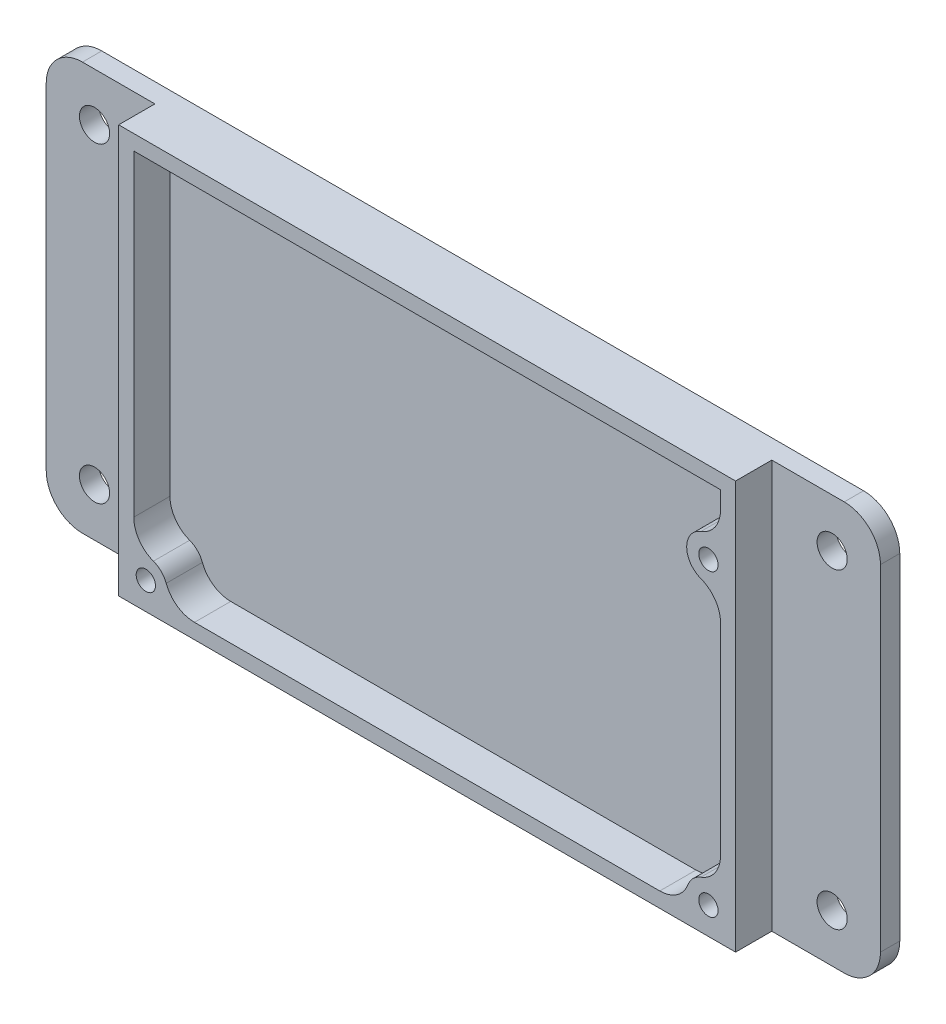
ISO-10303-21;
HEADER;
FILE_DESCRIPTION(('STEP AP214'),'2;1');
FILE_NAME('part.step','',(''),(''),'','','');
FILE_SCHEMA(('AUTOMOTIVE_DESIGN { 1 0 10303 214 1 1 1 1 }'));
ENDSEC;
DATA;
#1=APPLICATION_CONTEXT('core data for automotive mechanical design processes');
#2=APPLICATION_PROTOCOL_DEFINITION('international standard','automotive_design',2000,#1);
#3=PRODUCT_CONTEXT('',#1,'mechanical');
#4=PRODUCT('Part','Part','',(#3));
#5=PRODUCT_RELATED_PRODUCT_CATEGORY('part','',(#4));
#6=PRODUCT_DEFINITION_FORMATION('','',#4);
#7=PRODUCT_DEFINITION_CONTEXT('part definition',#1,'design');
#8=PRODUCT_DEFINITION('design','',#6,#7);
#9=PRODUCT_DEFINITION_SHAPE('','',#8);
#10=(LENGTH_UNIT() NAMED_UNIT(*) SI_UNIT(.MILLI.,.METRE.));
#11=(NAMED_UNIT(*) PLANE_ANGLE_UNIT() SI_UNIT($,.RADIAN.));
#12=(NAMED_UNIT(*) SI_UNIT($,.STERADIAN.) SOLID_ANGLE_UNIT());
#13=UNCERTAINTY_MEASURE_WITH_UNIT(LENGTH_MEASURE(1.E-05),#10,'distance_accuracy_value','');
#14=(GEOMETRIC_REPRESENTATION_CONTEXT(3) GLOBAL_UNCERTAINTY_ASSIGNED_CONTEXT((#13)) GLOBAL_UNIT_ASSIGNED_CONTEXT((#10,
#11,#12)) REPRESENTATION_CONTEXT('',''));
#15=CARTESIAN_POINT('',(0.,0.,0.));
#16=DIRECTION('',(0.,0.,1.));
#17=DIRECTION('',(1.,0.,0.));
#18=AXIS2_PLACEMENT_3D('',#15,#16,#17);
#19=CARTESIAN_POINT('',(0.,0.,6.));
#20=DIRECTION('',(0.,1.,0.));
#21=DIRECTION('',(0.,0.,1.));
#22=AXIS2_PLACEMENT_3D('',#19,#20,#21);
#23=PLANE('',#22);
#24=DIRECTION('',(-1.,0.,0.));
#25=VECTOR('',#24,1.);
#26=CARTESIAN_POINT('',(120.2,0.,-3.2));
#27=LINE('',#26,#25);
#28=CARTESIAN_POINT('',(114.2,0.,-3.2));
#29=VERTEX_POINT('',#28);
#30=CARTESIAN_POINT('',(-12.,0.,-3.2));
#31=VERTEX_POINT('',#30);
#32=EDGE_CURVE('E856',#29,#31,#27,.T.);
#33=ORIENTED_EDGE('',*,*,#32,.F.);
#34=DIRECTION('',(0.,0.,1.));
#35=VECTOR('',#34,1.);
#36=CARTESIAN_POINT('',(114.2,0.,6.));
#37=LINE('',#36,#35);
#38=CARTESIAN_POINT('',(114.2,0.,0.));
#39=VERTEX_POINT('',#38);
#40=EDGE_CURVE('E282',#29,#39,#37,.T.);
#41=ORIENTED_EDGE('',*,*,#40,.T.);
#42=DIRECTION('',(-1.,0.,0.));
#43=VECTOR('',#42,1.);
#44=CARTESIAN_POINT('',(120.2,0.,0.));
#45=LINE('',#44,#43);
#46=CARTESIAN_POINT('',(102.2,0.,0.));
#47=VERTEX_POINT('',#46);
#48=EDGE_CURVE('E866',#39,#47,#45,.T.);
#49=ORIENTED_EDGE('',*,*,#48,.T.);
#50=DIRECTION('',(0.,0.,-1.));
#51=VECTOR('',#50,1.);
#52=CARTESIAN_POINT('',(102.2,0.,6.));
#53=LINE('',#52,#51);
#54=CARTESIAN_POINT('',(102.2,0.,6.));
#55=VERTEX_POINT('',#54);
#56=EDGE_CURVE('E246',#55,#47,#53,.T.);
#57=ORIENTED_EDGE('',*,*,#56,.F.);
#58=DIRECTION('',(1.,0.,0.));
#59=VECTOR('',#58,1.);
#60=CARTESIAN_POINT('',(0.,0.,6.));
#61=LINE('',#60,#59);
#62=CARTESIAN_POINT('',(0.,0.,6.));
#63=VERTEX_POINT('',#62);
#64=EDGE_CURVE('E408',#63,#55,#61,.T.);
#65=ORIENTED_EDGE('',*,*,#64,.F.);
#66=DIRECTION('',(0.,0.,-1.));
#67=VECTOR('',#66,1.);
#68=CARTESIAN_POINT('',(0.,0.,6.));
#69=LINE('',#68,#67);
#70=CARTESIAN_POINT('',(0.,0.,0.));
#71=VERTEX_POINT('',#70);
#72=EDGE_CURVE('E243',#63,#71,#69,.T.);
#73=ORIENTED_EDGE('',*,*,#72,.T.);
#74=CARTESIAN_POINT('',(-12.,0.,0.));
#75=VERTEX_POINT('',#74);
#76=EDGE_CURVE('E232',#71,#75,#45,.T.);
#77=ORIENTED_EDGE('',*,*,#76,.T.);
#78=DIRECTION('',(0.,0.,1.));
#79=VECTOR('',#78,1.);
#80=CARTESIAN_POINT('',(-12.,0.,6.));
#81=LINE('',#80,#79);
#82=EDGE_CURVE('E280',#75,#31,#81,.F.);
#83=ORIENTED_EDGE('',*,*,#82,.T.);
#84=EDGE_LOOP('',(#33,#41,#49,#57,#65,#73,#77,#83));
#85=FACE_BOUND('',#84,.T.);
#86=ADVANCED_FACE('F38',(#85),#23,.F.);
#87=CARTESIAN_POINT('',(102.2,0.,6.));
#88=DIRECTION('',(-1.,0.,0.));
#89=DIRECTION('',(0.,0.,1.));
#90=AXIS2_PLACEMENT_3D('',#87,#88,#89);
#91=PLANE('',#90);
#92=DIRECTION('',(0.,1.,0.));
#93=VECTOR('',#92,1.);
#94=CARTESIAN_POINT('',(102.2,0.,0.));
#95=LINE('',#94,#93);
#96=CARTESIAN_POINT('',(102.2,67.6,0.));
#97=VERTEX_POINT('',#96);
#98=EDGE_CURVE('E236',#47,#97,#95,.T.);
#99=ORIENTED_EDGE('',*,*,#98,.T.);
#100=DIRECTION('',(0.,0.,-1.));
#101=VECTOR('',#100,1.);
#102=CARTESIAN_POINT('',(102.2,67.6,6.));
#103=LINE('',#102,#101);
#104=CARTESIAN_POINT('',(102.2,67.6,6.));
#105=VERTEX_POINT('',#104);
#106=EDGE_CURVE('E242',#105,#97,#103,.T.);
#107=ORIENTED_EDGE('',*,*,#106,.F.);
#108=DIRECTION('',(0.,1.,0.));
#109=VECTOR('',#108,1.);
#110=CARTESIAN_POINT('',(102.2,0.,6.));
#111=LINE('',#110,#109);
#112=EDGE_CURVE('E411',#55,#105,#111,.T.);
#113=ORIENTED_EDGE('',*,*,#112,.F.);
#114=ORIENTED_EDGE('',*,*,#56,.T.);
#115=EDGE_LOOP('',(#99,#107,#113,#114));
#116=FACE_BOUND('',#115,.T.);
#117=ADVANCED_FACE('F478',(#116),#91,.F.);
#118=CARTESIAN_POINT('',(0.,67.6,6.));
#119=DIRECTION('',(0.,1.,0.));
#120=DIRECTION('',(0.,0.,1.));
#121=AXIS2_PLACEMENT_3D('',#118,#119,#120);
#122=PLANE('',#121);
#123=DIRECTION('',(1.,0.,0.));
#124=VECTOR('',#123,1.);
#125=CARTESIAN_POINT('',(120.2,67.6,0.));
#126=LINE('',#125,#124);
#127=CARTESIAN_POINT('',(114.2,67.6,0.));
#128=VERTEX_POINT('',#127);
#129=EDGE_CURVE('E226',#97,#128,#126,.T.);
#130=ORIENTED_EDGE('',*,*,#129,.T.);
#131=DIRECTION('',(0.,0.,1.));
#132=VECTOR('',#131,1.);
#133=CARTESIAN_POINT('',(114.2,67.6,-3.2));
#134=LINE('',#133,#132);
#135=CARTESIAN_POINT('',(114.2,67.6,-3.2));
#136=VERTEX_POINT('',#135);
#137=EDGE_CURVE('E270',#128,#136,#134,.F.);
#138=ORIENTED_EDGE('',*,*,#137,.T.);
#139=DIRECTION('',(1.,0.,0.));
#140=VECTOR('',#139,1.);
#141=CARTESIAN_POINT('',(120.2,67.6,-3.2));
#142=LINE('',#141,#140);
#143=CARTESIAN_POINT('',(-12.,67.6,-3.2));
#144=VERTEX_POINT('',#143);
#145=EDGE_CURVE('E425',#144,#136,#142,.T.);
#146=ORIENTED_EDGE('',*,*,#145,.F.);
#147=DIRECTION('',(0.,0.,1.));
#148=VECTOR('',#147,1.);
#149=CARTESIAN_POINT('',(-12.,67.6,0.));
#150=LINE('',#149,#148);
#151=CARTESIAN_POINT('',(-12.,67.6,0.));
#152=VERTEX_POINT('',#151);
#153=EDGE_CURVE('E223',#144,#152,#150,.T.);
#154=ORIENTED_EDGE('',*,*,#153,.T.);
#155=CARTESIAN_POINT('',(0.,67.6,0.));
#156=VERTEX_POINT('',#155);
#157=EDGE_CURVE('E213',#152,#156,#126,.T.);
#158=ORIENTED_EDGE('',*,*,#157,.T.);
#159=DIRECTION('',(0.,0.,-1.));
#160=VECTOR('',#159,1.);
#161=CARTESIAN_POINT('',(0.,67.6,6.));
#162=LINE('',#161,#160);
#163=CARTESIAN_POINT('',(0.,67.6,6.));
#164=VERTEX_POINT('',#163);
#165=EDGE_CURVE('E219',#164,#156,#162,.T.);
#166=ORIENTED_EDGE('',*,*,#165,.F.);
#167=DIRECTION('',(1.,0.,0.));
#168=VECTOR('',#167,1.);
#169=CARTESIAN_POINT('',(0.,67.6,6.));
#170=LINE('',#169,#168);
#171=EDGE_CURVE('E413',#164,#105,#170,.T.);
#172=ORIENTED_EDGE('',*,*,#171,.T.);
#173=ORIENTED_EDGE('',*,*,#106,.T.);
#174=EDGE_LOOP('',(#130,#138,#146,#154,#158,#166,#172,#173));
#175=FACE_BOUND('',#174,.T.);
#176=ADVANCED_FACE('F216',(#175),#122,.T.);
#177=CARTESIAN_POINT('',(4.5,4.5,6.));
#178=DIRECTION('',(0.,0.,-1.));
#179=DIRECTION('',(-1.,0.,0.));
#180=AXIS2_PLACEMENT_3D('',#177,#178,#179);
#181=CYLINDRICAL_SURFACE('',#180,3.6);
#182=CARTESIAN_POINT('',(4.5,4.5,6.));
#183=DIRECTION('',(0.,0.,1.));
#184=DIRECTION('',(1.,0.,0.));
#185=AXIS2_PLACEMENT_3D('',#182,#183,#184);
#186=CIRCLE('',#185,3.6);
#187=CARTESIAN_POINT('',(7.87386000216723,5.75581395348837,6.));
#188=VERTEX_POINT('',#187);
#189=CARTESIAN_POINT('',(5.75581395348837,7.87386000216723,6.));
#190=VERTEX_POINT('',#189);
#191=EDGE_CURVE('E385',#188,#190,#186,.T.);
#192=ORIENTED_EDGE('',*,*,#191,.F.);
#193=DIRECTION('',(0.,0.,-1.));
#194=VECTOR('',#193,1.);
#195=CARTESIAN_POINT('',(7.87386000216724,5.75581395348837,6.));
#196=LINE('',#195,#194);
#197=CARTESIAN_POINT('',(7.87386000216723,5.75581395348837,0.));
#198=VERTEX_POINT('',#197);
#199=EDGE_CURVE('E315',#188,#198,#196,.T.);
#200=ORIENTED_EDGE('',*,*,#199,.T.);
#201=CARTESIAN_POINT('',(4.5,4.5,0.));
#202=DIRECTION('',(0.,0.,1.));
#203=DIRECTION('',(1.,0.,0.));
#204=AXIS2_PLACEMENT_3D('',#201,#202,#203);
#205=CIRCLE('',#204,3.6);
#206=CARTESIAN_POINT('',(5.75581395348837,7.87386000216723,0.));
#207=VERTEX_POINT('',#206);
#208=EDGE_CURVE('E421',#198,#207,#205,.T.);
#209=ORIENTED_EDGE('',*,*,#208,.T.);
#210=DIRECTION('',(0.,0.,-1.));
#211=VECTOR('',#210,1.);
#212=CARTESIAN_POINT('',(5.75581395348837,7.87386000216724,6.));
#213=LINE('',#212,#211);
#214=EDGE_CURVE('E313',#207,#190,#213,.F.);
#215=ORIENTED_EDGE('',*,*,#214,.T.);
#216=EDGE_LOOP('',(#192,#200,#209,#215));
#217=FACE_BOUND('',#216,.T.);
#218=ADVANCED_FACE('F465',(#217),#181,.T.);
#219=CARTESIAN_POINT('',(2.5,0.,6.));
#220=DIRECTION('',(-1.,0.,0.));
#221=DIRECTION('',(0.,0.,1.));
#222=AXIS2_PLACEMENT_3D('',#219,#220,#221);
#223=PLANE('',#222);
#224=DIRECTION('',(0.,1.,0.));
#225=VECTOR('',#224,1.);
#226=CARTESIAN_POINT('',(2.5,0.,6.));
#227=LINE('',#226,#225);
#228=CARTESIAN_POINT('',(2.5,12.559776671844,6.));
#229=VERTEX_POINT('',#228);
#230=CARTESIAN_POINT('',(2.5,65.1,6.));
#231=VERTEX_POINT('',#230);
#232=EDGE_CURVE('E389',#229,#231,#227,.T.);
#233=ORIENTED_EDGE('',*,*,#232,.F.);
#234=DIRECTION('',(0.,0.,1.));
#235=VECTOR('',#234,1.);
#236=CARTESIAN_POINT('',(2.5,12.559776671844,0.));
#237=LINE('',#236,#235);
#238=CARTESIAN_POINT('',(2.5,12.559776671844,0.));
#239=VERTEX_POINT('',#238);
#240=EDGE_CURVE('E331',#229,#239,#237,.F.);
#241=ORIENTED_EDGE('',*,*,#240,.T.);
#242=DIRECTION('',(0.,1.,0.));
#243=VECTOR('',#242,1.);
#244=CARTESIAN_POINT('',(2.5,0.,0.));
#245=LINE('',#244,#243);
#246=CARTESIAN_POINT('',(2.5,65.1,0.));
#247=VERTEX_POINT('',#246);
#248=EDGE_CURVE('E424',#239,#247,#245,.T.);
#249=ORIENTED_EDGE('',*,*,#248,.T.);
#250=DIRECTION('',(0.,0.,-1.));
#251=VECTOR('',#250,1.);
#252=CARTESIAN_POINT('',(2.5,65.1,6.));
#253=LINE('',#252,#251);
#254=EDGE_CURVE('E248',#231,#247,#253,.T.);
#255=ORIENTED_EDGE('',*,*,#254,.F.);
#256=EDGE_LOOP('',(#233,#241,#249,#255));
#257=FACE_BOUND('',#256,.T.);
#258=ADVANCED_FACE('F459',(#257),#223,.F.);
#259=CARTESIAN_POINT('',(0.,65.1,6.));
#260=DIRECTION('',(0.,1.,0.));
#261=DIRECTION('',(0.,0.,1.));
#262=AXIS2_PLACEMENT_3D('',#259,#260,#261);
#263=PLANE('',#262);
#264=DIRECTION('',(1.,0.,0.));
#265=VECTOR('',#264,1.);
#266=CARTESIAN_POINT('',(0.,65.1,0.));
#267=LINE('',#266,#265);
#268=CARTESIAN_POINT('',(99.7,65.1,0.));
#269=VERTEX_POINT('',#268);
#270=EDGE_CURVE('E427',#247,#269,#267,.T.);
#271=ORIENTED_EDGE('',*,*,#270,.T.);
#272=DIRECTION('',(0.,0.,-1.));
#273=VECTOR('',#272,1.);
#274=CARTESIAN_POINT('',(99.7,65.1,6.));
#275=LINE('',#274,#273);
#276=CARTESIAN_POINT('',(99.7,65.1,6.));
#277=VERTEX_POINT('',#276);
#278=EDGE_CURVE('E255',#277,#269,#275,.T.);
#279=ORIENTED_EDGE('',*,*,#278,.F.);
#280=DIRECTION('',(1.,0.,0.));
#281=VECTOR('',#280,1.);
#282=CARTESIAN_POINT('',(0.,65.1,6.));
#283=LINE('',#282,#281);
#284=EDGE_CURVE('E393',#231,#277,#283,.T.);
#285=ORIENTED_EDGE('',*,*,#284,.F.);
#286=ORIENTED_EDGE('',*,*,#254,.T.);
#287=EDGE_LOOP('',(#271,#279,#285,#286));
#288=FACE_BOUND('',#287,.T.);
#289=ADVANCED_FACE('F454',(#288),#263,.F.);
#290=CARTESIAN_POINT('',(99.7,0.,6.));
#291=DIRECTION('',(-1.,0.,0.));
#292=DIRECTION('',(0.,0.,1.));
#293=AXIS2_PLACEMENT_3D('',#290,#291,#292);
#294=PLANE('',#293);
#295=DIRECTION('',(0.,1.,0.));
#296=VECTOR('',#295,1.);
#297=CARTESIAN_POINT('',(99.7,0.,0.));
#298=LINE('',#297,#296);
#299=CARTESIAN_POINT('',(99.7,62.159776671844,0.));
#300=VERTEX_POINT('',#299);
#301=EDGE_CURVE('E375',#300,#269,#298,.T.);
#302=ORIENTED_EDGE('',*,*,#301,.F.);
#303=DIRECTION('',(0.,0.,-1.));
#304=VECTOR('',#303,1.);
#305=CARTESIAN_POINT('',(99.7,62.159776671844,6.));
#306=LINE('',#305,#304);
#307=CARTESIAN_POINT('',(99.7,62.159776671844,6.));
#308=VERTEX_POINT('',#307);
#309=EDGE_CURVE('E303',#300,#308,#306,.F.);
#310=ORIENTED_EDGE('',*,*,#309,.T.);
#311=DIRECTION('',(0.,1.,0.));
#312=VECTOR('',#311,1.);
#313=CARTESIAN_POINT('',(99.7,0.,6.));
#314=LINE('',#313,#312);
#315=EDGE_CURVE('E399',#308,#277,#314,.T.);
#316=ORIENTED_EDGE('',*,*,#315,.T.);
#317=ORIENTED_EDGE('',*,*,#278,.T.);
#318=EDGE_LOOP('',(#302,#310,#316,#317));
#319=FACE_BOUND('',#318,.T.);
#320=ADVANCED_FACE('F450',(#319),#294,.T.);
#321=CARTESIAN_POINT('',(97.7,54.1,6.));
#322=DIRECTION('',(0.,0.,-1.));
#323=DIRECTION('',(-1.,0.,0.));
#324=AXIS2_PLACEMENT_3D('',#321,#322,#323);
#325=CYLINDRICAL_SURFACE('',#324,3.6);
#326=CARTESIAN_POINT('',(97.7,54.1,6.));
#327=DIRECTION('',(0.,0.,1.));
#328=DIRECTION('',(1.,0.,0.));
#329=AXIS2_PLACEMENT_3D('',#326,#327,#328);
#330=CIRCLE('',#329,3.6);
#331=CARTESIAN_POINT('',(96.4441860465116,57.4738600021672,6.));
#332=VERTEX_POINT('',#331);
#333=CARTESIAN_POINT('',(96.4441860465116,50.7261399978328,6.));
#334=VERTEX_POINT('',#333);
#335=EDGE_CURVE('E401',#332,#334,#330,.T.);
#336=ORIENTED_EDGE('',*,*,#335,.F.);
#337=DIRECTION('',(0.,0.,-1.));
#338=VECTOR('',#337,1.);
#339=CARTESIAN_POINT('',(96.4441860465116,57.4738600021672,6.));
#340=LINE('',#339,#338);
#341=CARTESIAN_POINT('',(96.4441860465116,57.4738600021672,0.));
#342=VERTEX_POINT('',#341);
#343=EDGE_CURVE('E296',#332,#342,#340,.T.);
#344=ORIENTED_EDGE('',*,*,#343,.T.);
#345=CARTESIAN_POINT('',(97.7,54.1,0.));
#346=DIRECTION('',(0.,0.,1.));
#347=DIRECTION('',(1.,0.,0.));
#348=AXIS2_PLACEMENT_3D('',#345,#346,#347);
#349=CIRCLE('',#348,3.6);
#350=CARTESIAN_POINT('',(96.4441860465116,50.7261399978328,0.));
#351=VERTEX_POINT('',#350);
#352=EDGE_CURVE('E373',#342,#351,#349,.T.);
#353=ORIENTED_EDGE('',*,*,#352,.T.);
#354=DIRECTION('',(0.,0.,-1.));
#355=VECTOR('',#354,1.);
#356=CARTESIAN_POINT('',(96.4441860465116,50.7261399978328,6.));
#357=LINE('',#356,#355);
#358=EDGE_CURVE('E294',#351,#334,#357,.F.);
#359=ORIENTED_EDGE('',*,*,#358,.T.);
#360=EDGE_LOOP('',(#336,#344,#353,#359));
#361=FACE_BOUND('',#360,.T.);
#362=ADVANCED_FACE('F436',(#361),#325,.T.);
#363=CARTESIAN_POINT('',(99.7,12.559776671844,0.));
#364=VERTEX_POINT('',#363);
#365=CARTESIAN_POINT('',(99.7,46.040223328156,0.));
#366=VERTEX_POINT('',#365);
#367=EDGE_CURVE('E369',#364,#366,#298,.T.);
#368=ORIENTED_EDGE('',*,*,#367,.F.);
#369=DIRECTION('',(0.,0.,-1.));
#370=VECTOR('',#369,1.);
#371=CARTESIAN_POINT('',(99.7,12.559776671844,6.));
#372=LINE('',#371,#370);
#373=CARTESIAN_POINT('',(99.7,12.559776671844,6.));
#374=VERTEX_POINT('',#373);
#375=EDGE_CURVE('E53',#364,#374,#372,.F.);
#376=ORIENTED_EDGE('',*,*,#375,.T.);
#377=CARTESIAN_POINT('',(99.7,46.040223328156,6.));
#378=VERTEX_POINT('',#377);
#379=EDGE_CURVE('E402',#374,#378,#314,.T.);
#380=ORIENTED_EDGE('',*,*,#379,.T.);
#381=DIRECTION('',(0.,0.,-1.));
#382=VECTOR('',#381,1.);
#383=CARTESIAN_POINT('',(99.7,46.040223328156,6.));
#384=LINE('',#383,#382);
#385=EDGE_CURVE('E305',#378,#366,#384,.T.);
#386=ORIENTED_EDGE('',*,*,#385,.T.);
#387=EDGE_LOOP('',(#368,#376,#380,#386));
#388=FACE_BOUND('',#387,.T.);
#389=ADVANCED_FACE('F499',(#388),#294,.T.);
#390=CARTESIAN_POINT('',(97.7,4.5,6.));
#391=DIRECTION('',(0.,0.,-1.));
#392=DIRECTION('',(-1.,0.,0.));
#393=AXIS2_PLACEMENT_3D('',#390,#391,#392);
#394=CYLINDRICAL_SURFACE('',#393,3.6);
#395=CARTESIAN_POINT('',(97.7,4.5,0.));
#396=DIRECTION('',(0.,0.,1.));
#397=DIRECTION('',(1.,0.,0.));
#398=AXIS2_PLACEMENT_3D('',#395,#396,#397);
#399=CIRCLE('',#398,3.6);
#400=CARTESIAN_POINT('',(96.4441860465116,7.87386000216723,0.));
#401=VERTEX_POINT('',#400);
#402=CARTESIAN_POINT('',(94.3261399978328,5.75581395348837,0.));
#403=VERTEX_POINT('',#402);
#404=EDGE_CURVE('E365',#401,#403,#399,.T.);
#405=ORIENTED_EDGE('',*,*,#404,.T.);
#406=DIRECTION('',(0.,0.,-1.));
#407=VECTOR('',#406,1.);
#408=CARTESIAN_POINT('',(94.3261399978328,5.75581395348837,6.));
#409=LINE('',#408,#407);
#410=CARTESIAN_POINT('',(94.3261399978328,5.75581395348837,6.));
#411=VERTEX_POINT('',#410);
#412=EDGE_CURVE('E61',#403,#411,#409,.F.);
#413=ORIENTED_EDGE('',*,*,#412,.T.);
#414=CARTESIAN_POINT('',(97.7,4.5,6.));
#415=DIRECTION('',(0.,0.,1.));
#416=DIRECTION('',(1.,0.,0.));
#417=AXIS2_PLACEMENT_3D('',#414,#415,#416);
#418=CIRCLE('',#417,3.6);
#419=CARTESIAN_POINT('',(96.4441860465116,7.87386000216723,6.));
#420=VERTEX_POINT('',#419);
#421=EDGE_CURVE('E350',#420,#411,#418,.T.);
#422=ORIENTED_EDGE('',*,*,#421,.F.);
#423=DIRECTION('',(0.,0.,-1.));
#424=VECTOR('',#423,1.);
#425=CARTESIAN_POINT('',(96.4441860465116,7.87386000216723,6.));
#426=LINE('',#425,#424);
#427=EDGE_CURVE('E334',#420,#401,#426,.T.);
#428=ORIENTED_EDGE('',*,*,#427,.T.);
#429=EDGE_LOOP('',(#405,#413,#422,#428));
#430=FACE_BOUND('',#429,.T.);
#431=ADVANCED_FACE('F367',(#430),#394,.T.);
#432=CARTESIAN_POINT('',(4.5,4.5,6.));
#433=DIRECTION('',(0.,0.,-1.));
#434=DIRECTION('',(-1.,0.,0.));
#435=AXIS2_PLACEMENT_3D('',#432,#433,#434);
#436=CYLINDRICAL_SURFACE('',#435,1.6);
#437=CARTESIAN_POINT('',(4.5,4.5,6.));
#438=DIRECTION('',(0.,0.,1.));
#439=DIRECTION('',(1.,0.,0.));
#440=AXIS2_PLACEMENT_3D('',#437,#438,#439);
#441=CIRCLE('',#440,1.6);
#442=CARTESIAN_POINT('',(6.1,4.5,6.));
#443=VERTEX_POINT('',#442);
#444=EDGE_CURVE('E416',#443,#443,#441,.T.);
#445=ORIENTED_EDGE('',*,*,#444,.T.);
#446=EDGE_LOOP('',(#445));
#447=FACE_BOUND('',#446,.T.);
#448=CARTESIAN_POINT('',(4.5,4.5,0.));
#449=DIRECTION('',(0.,0.,1.));
#450=DIRECTION('',(1.,0.,0.));
#451=AXIS2_PLACEMENT_3D('',#448,#449,#450);
#452=CIRCLE('',#451,1.6);
#453=CARTESIAN_POINT('',(6.1,4.5,0.));
#454=VERTEX_POINT('',#453);
#455=EDGE_CURVE('E235',#454,#454,#452,.T.);
#456=ORIENTED_EDGE('',*,*,#455,.F.);
#457=EDGE_LOOP('',(#456));
#458=FACE_BOUND('',#457,.T.);
#459=ADVANCED_FACE('F498',(#447,#458),#436,.F.);
#460=CARTESIAN_POINT('',(0.,0.,6.));
#461=DIRECTION('',(-1.,0.,0.));
#462=DIRECTION('',(0.,0.,1.));
#463=AXIS2_PLACEMENT_3D('',#460,#461,#462);
#464=PLANE('',#463);
#465=DIRECTION('',(0.,1.,0.));
#466=VECTOR('',#465,1.);
#467=CARTESIAN_POINT('',(0.,0.,0.));
#468=LINE('',#467,#466);
#469=EDGE_CURVE('E229',#71,#156,#468,.T.);
#470=ORIENTED_EDGE('',*,*,#469,.F.);
#471=ORIENTED_EDGE('',*,*,#72,.F.);
#472=DIRECTION('',(0.,1.,0.));
#473=VECTOR('',#472,1.);
#474=CARTESIAN_POINT('',(0.,0.,6.));
#475=LINE('',#474,#473);
#476=EDGE_CURVE('E241',#63,#164,#475,.T.);
#477=ORIENTED_EDGE('',*,*,#476,.T.);
#478=ORIENTED_EDGE('',*,*,#165,.T.);
#479=EDGE_LOOP('',(#470,#471,#477,#478));
#480=FACE_BOUND('',#479,.T.);
#481=ADVANCED_FACE('F239',(#480),#464,.T.);
#482=CARTESIAN_POINT('',(97.7,54.1,6.));
#483=DIRECTION('',(0.,0.,-1.));
#484=DIRECTION('',(-1.,0.,0.));
#485=AXIS2_PLACEMENT_3D('',#482,#483,#484);
#486=CYLINDRICAL_SURFACE('',#485,1.60000000000001);
#487=CARTESIAN_POINT('',(97.7,54.1,6.));
#488=DIRECTION('',(0.,0.,1.));
#489=DIRECTION('',(1.,0.,0.));
#490=AXIS2_PLACEMENT_3D('',#487,#488,#489);
#491=CIRCLE('',#490,1.60000000000001);
#492=CARTESIAN_POINT('',(99.3,54.1,6.));
#493=VERTEX_POINT('',#492);
#494=EDGE_CURVE('E358',#493,#493,#491,.T.);
#495=ORIENTED_EDGE('',*,*,#494,.T.);
#496=EDGE_LOOP('',(#495));
#497=FACE_BOUND('',#496,.T.);
#498=CARTESIAN_POINT('',(97.7,54.1,0.));
#499=DIRECTION('',(0.,0.,1.));
#500=DIRECTION('',(1.,0.,0.));
#501=AXIS2_PLACEMENT_3D('',#498,#499,#500);
#502=CIRCLE('',#501,1.60000000000001);
#503=CARTESIAN_POINT('',(99.3,54.1,0.));
#504=VERTEX_POINT('',#503);
#505=EDGE_CURVE('E371',#504,#504,#502,.T.);
#506=ORIENTED_EDGE('',*,*,#505,.F.);
#507=EDGE_LOOP('',(#506));
#508=FACE_BOUND('',#507,.T.);
#509=ADVANCED_FACE('F489',(#497,#508),#486,.F.);
#510=CARTESIAN_POINT('',(0.,2.5,6.));
#511=DIRECTION('',(0.,1.,0.));
#512=DIRECTION('',(-1.,0.,0.));
#513=AXIS2_PLACEMENT_3D('',#510,#511,#512);
#514=PLANE('',#513);
#515=DIRECTION('',(1.,0.,0.));
#516=VECTOR('',#515,1.);
#517=CARTESIAN_POINT('',(0.,2.5,0.));
#518=LINE('',#517,#516);
#519=CARTESIAN_POINT('',(12.559776671844,2.5,0.));
#520=VERTEX_POINT('',#519);
#521=CARTESIAN_POINT('',(89.640223328156,2.5,0.));
#522=VERTEX_POINT('',#521);
#523=EDGE_CURVE('E366',#520,#522,#518,.T.);
#524=ORIENTED_EDGE('',*,*,#523,.F.);
#525=DIRECTION('',(0.,0.,-1.));
#526=VECTOR('',#525,1.);
#527=CARTESIAN_POINT('',(12.559776671844,2.5,6.));
#528=LINE('',#527,#526);
#529=CARTESIAN_POINT('',(12.559776671844,2.5,6.));
#530=VERTEX_POINT('',#529);
#531=EDGE_CURVE('E329',#520,#530,#528,.F.);
#532=ORIENTED_EDGE('',*,*,#531,.T.);
#533=DIRECTION('',(1.,0.,0.));
#534=VECTOR('',#533,1.);
#535=CARTESIAN_POINT('',(0.,2.5,6.));
#536=LINE('',#535,#534);
#537=CARTESIAN_POINT('',(89.640223328156,2.5,6.));
#538=VERTEX_POINT('',#537);
#539=EDGE_CURVE('E348',#530,#538,#536,.T.);
#540=ORIENTED_EDGE('',*,*,#539,.T.);
#541=DIRECTION('',(0.,0.,-1.));
#542=VECTOR('',#541,1.);
#543=CARTESIAN_POINT('',(89.640223328156,2.5,6.));
#544=LINE('',#543,#542);
#545=EDGE_CURVE('E326',#538,#522,#544,.T.);
#546=ORIENTED_EDGE('',*,*,#545,.T.);
#547=EDGE_LOOP('',(#524,#532,#540,#546));
#548=FACE_BOUND('',#547,.T.);
#549=ADVANCED_FACE('F355',(#548),#514,.T.);
#550=CARTESIAN_POINT('',(97.7,4.5,6.));
#551=DIRECTION('',(0.,0.,-1.));
#552=DIRECTION('',(-1.,0.,0.));
#553=AXIS2_PLACEMENT_3D('',#550,#551,#552);
#554=CYLINDRICAL_SURFACE('',#553,1.60000000000001);
#555=CARTESIAN_POINT('',(97.7,4.5,6.));
#556=DIRECTION('',(0.,0.,1.));
#557=DIRECTION('',(1.,0.,0.));
#558=AXIS2_PLACEMENT_3D('',#555,#556,#557);
#559=CIRCLE('',#558,1.60000000000001);
#560=CARTESIAN_POINT('',(99.3,4.5,6.));
#561=VERTEX_POINT('',#560);
#562=EDGE_CURVE('E258',#561,#561,#559,.T.);
#563=ORIENTED_EDGE('',*,*,#562,.T.);
#564=EDGE_LOOP('',(#563));
#565=FACE_BOUND('',#564,.T.);
#566=CARTESIAN_POINT('',(97.7,4.5,0.));
#567=DIRECTION('',(0.,0.,1.));
#568=DIRECTION('',(1.,0.,0.));
#569=AXIS2_PLACEMENT_3D('',#566,#567,#568);
#570=CIRCLE('',#569,1.60000000000001);
#571=CARTESIAN_POINT('',(99.3,4.5,0.));
#572=VERTEX_POINT('',#571);
#573=EDGE_CURVE('E383',#572,#572,#570,.T.);
#574=ORIENTED_EDGE('',*,*,#573,.F.);
#575=EDGE_LOOP('',(#574));
#576=FACE_BOUND('',#575,.T.);
#577=ADVANCED_FACE('F495',(#565,#576),#554,.F.);
#578=CARTESIAN_POINT('',(0.,0.,6.));
#579=DIRECTION('',(0.,0.,1.));
#580=DIRECTION('',(1.,0.,0.));
#581=AXIS2_PLACEMENT_3D('',#578,#579,#580);
#582=PLANE('',#581);
#583=ORIENTED_EDGE('',*,*,#539,.F.);
#584=CARTESIAN_POINT('',(12.559776671844,7.5,6.));
#585=DIRECTION('',(0.,0.,1.));
#586=DIRECTION('',(1.,0.,0.));
#587=AXIS2_PLACEMENT_3D('',#584,#585,#586);
#588=CIRCLE('',#587,5.);
#589=EDGE_CURVE('E339',#530,#188,#588,.F.);
#590=ORIENTED_EDGE('',*,*,#589,.T.);
#591=ORIENTED_EDGE('',*,*,#191,.T.);
#592=CARTESIAN_POINT('',(7.5,12.559776671844,6.));
#593=DIRECTION('',(0.,0.,1.));
#594=DIRECTION('',(1.,0.,0.));
#595=AXIS2_PLACEMENT_3D('',#592,#593,#594);
#596=CIRCLE('',#595,5.);
#597=EDGE_CURVE('E341',#190,#229,#596,.F.);
#598=ORIENTED_EDGE('',*,*,#597,.T.);
#599=ORIENTED_EDGE('',*,*,#232,.T.);
#600=ORIENTED_EDGE('',*,*,#284,.T.);
#601=ORIENTED_EDGE('',*,*,#315,.F.);
#602=CARTESIAN_POINT('',(94.7,62.159776671844,6.));
#603=DIRECTION('',(0.,0.,1.));
#604=DIRECTION('',(1.,0.,0.));
#605=AXIS2_PLACEMENT_3D('',#602,#603,#604);
#606=CIRCLE('',#605,5.);
#607=EDGE_CURVE('E308',#308,#332,#606,.F.);
#608=ORIENTED_EDGE('',*,*,#607,.T.);
#609=ORIENTED_EDGE('',*,*,#335,.T.);
#610=CARTESIAN_POINT('',(94.7,46.040223328156,6.));
#611=DIRECTION('',(0.,0.,1.));
#612=DIRECTION('',(1.,0.,0.));
#613=AXIS2_PLACEMENT_3D('',#610,#611,#612);
#614=CIRCLE('',#613,5.);
#615=EDGE_CURVE('E310',#334,#378,#614,.F.);
#616=ORIENTED_EDGE('',*,*,#615,.T.);
#617=ORIENTED_EDGE('',*,*,#379,.F.);
#618=CARTESIAN_POINT('',(94.7,12.559776671844,6.));
#619=DIRECTION('',(0.,0.,1.));
#620=DIRECTION('',(1.,0.,0.));
#621=AXIS2_PLACEMENT_3D('',#618,#619,#620);
#622=CIRCLE('',#621,5.);
#623=EDGE_CURVE('E11',#374,#420,#622,.F.);
#624=ORIENTED_EDGE('',*,*,#623,.T.);
#625=ORIENTED_EDGE('',*,*,#421,.T.);
#626=CARTESIAN_POINT('',(89.640223328156,7.5,6.));
#627=DIRECTION('',(0.,0.,1.));
#628=DIRECTION('',(1.,0.,0.));
#629=AXIS2_PLACEMENT_3D('',#626,#627,#628);
#630=CIRCLE('',#629,5.);
#631=EDGE_CURVE('E46',#411,#538,#630,.F.);
#632=ORIENTED_EDGE('',*,*,#631,.T.);
#633=EDGE_LOOP('',(#583,#590,#591,#598,#599,#600,#601,#608,#609,#616,#617,#624,#625,#632));
#634=FACE_BOUND('',#633,.T.);
#635=ORIENTED_EDGE('',*,*,#494,.F.);
#636=EDGE_LOOP('',(#635));
#637=FACE_BOUND('',#636,.T.);
#638=ORIENTED_EDGE('',*,*,#64,.T.);
#639=ORIENTED_EDGE('',*,*,#112,.T.);
#640=ORIENTED_EDGE('',*,*,#171,.F.);
#641=ORIENTED_EDGE('',*,*,#476,.F.);
#642=EDGE_LOOP('',(#638,#639,#640,#641));
#643=FACE_BOUND('',#642,.T.);
#644=ORIENTED_EDGE('',*,*,#444,.F.);
#645=EDGE_LOOP('',(#644));
#646=FACE_BOUND('',#645,.T.);
#647=ORIENTED_EDGE('',*,*,#562,.F.);
#648=EDGE_LOOP('',(#647));
#649=FACE_BOUND('',#648,.T.);
#650=ADVANCED_FACE('F346',(#634,#637,#643,#646,#649),#582,.T.);
#651=CARTESIAN_POINT('',(0.,0.,0.));
#652=DIRECTION('',(0.,0.,1.));
#653=DIRECTION('',(1.,0.,0.));
#654=AXIS2_PLACEMENT_3D('',#651,#652,#653);
#655=PLANE('',#654);
#656=ORIENTED_EDGE('',*,*,#573,.T.);
#657=EDGE_LOOP('',(#656));
#658=FACE_BOUND('',#657,.T.);
#659=ADVANCED_FACE('F585',(#658),#655,.T.);
#660=ORIENTED_EDGE('',*,*,#455,.T.);
#661=EDGE_LOOP('',(#660));
#662=FACE_BOUND('',#661,.T.);
#663=ADVANCED_FACE('F598',(#662),#655,.T.);
#664=CARTESIAN_POINT('',(-9.99999999999999,59.6,-3.2));
#665=DIRECTION('',(0.,0.,1.));
#666=DIRECTION('',(1.,0.,0.));
#667=AXIS2_PLACEMENT_3D('',#664,#665,#666);
#668=CYLINDRICAL_SURFACE('',#667,2.5);
#669=CARTESIAN_POINT('',(-9.99999999999999,59.6,-3.2));
#670=DIRECTION('',(0.,0.,-1.));
#671=DIRECTION('',(1.,0.,0.));
#672=AXIS2_PLACEMENT_3D('',#669,#670,#671);
#673=CIRCLE('',#672,2.5);
#674=CARTESIAN_POINT('',(-7.49999999999999,59.6,-3.2));
#675=VERTEX_POINT('',#674);
#676=EDGE_CURVE('E832',#675,#675,#673,.T.);
#677=ORIENTED_EDGE('',*,*,#676,.T.);
#678=EDGE_LOOP('',(#677));
#679=FACE_BOUND('',#678,.T.);
#680=CARTESIAN_POINT('',(-9.99999999999999,59.6,0.));
#681=DIRECTION('',(0.,0.,-1.));
#682=DIRECTION('',(1.,0.,0.));
#683=AXIS2_PLACEMENT_3D('',#680,#681,#682);
#684=CIRCLE('',#683,2.5);
#685=CARTESIAN_POINT('',(-7.49999999999999,59.6,0.));
#686=VERTEX_POINT('',#685);
#687=EDGE_CURVE('E830',#686,#686,#684,.T.);
#688=ORIENTED_EDGE('',*,*,#687,.F.);
#689=EDGE_LOOP('',(#688));
#690=FACE_BOUND('',#689,.T.);
#691=ADVANCED_FACE('F691',(#679,#690),#668,.F.);
#692=CARTESIAN_POINT('',(-10.,8.00000000000002,-3.2));
#693=DIRECTION('',(0.,0.,1.));
#694=DIRECTION('',(1.,0.,0.));
#695=AXIS2_PLACEMENT_3D('',#692,#693,#694);
#696=CYLINDRICAL_SURFACE('',#695,2.5);
#697=CARTESIAN_POINT('',(-10.,8.00000000000002,-3.2));
#698=DIRECTION('',(0.,0.,-1.));
#699=DIRECTION('',(1.,0.,0.));
#700=AXIS2_PLACEMENT_3D('',#697,#698,#699);
#701=CIRCLE('',#700,2.5);
#702=CARTESIAN_POINT('',(-7.50000000000001,8.00000000000002,-3.2));
#703=VERTEX_POINT('',#702);
#704=EDGE_CURVE('E837',#703,#703,#701,.T.);
#705=ORIENTED_EDGE('',*,*,#704,.T.);
#706=EDGE_LOOP('',(#705));
#707=FACE_BOUND('',#706,.T.);
#708=CARTESIAN_POINT('',(-10.,8.00000000000002,0.));
#709=DIRECTION('',(0.,0.,-1.));
#710=DIRECTION('',(1.,0.,0.));
#711=AXIS2_PLACEMENT_3D('',#708,#709,#710);
#712=CIRCLE('',#711,2.5);
#713=CARTESIAN_POINT('',(-7.50000000000001,8.00000000000002,0.));
#714=VERTEX_POINT('',#713);
#715=EDGE_CURVE('E827',#714,#714,#712,.T.);
#716=ORIENTED_EDGE('',*,*,#715,.F.);
#717=EDGE_LOOP('',(#716));
#718=FACE_BOUND('',#717,.T.);
#719=ADVANCED_FACE('F700',(#707,#718),#696,.F.);
#720=CARTESIAN_POINT('',(112.2,8.,-3.2));
#721=DIRECTION('',(0.,0.,1.));
#722=DIRECTION('',(1.,0.,0.));
#723=AXIS2_PLACEMENT_3D('',#720,#721,#722);
#724=CYLINDRICAL_SURFACE('',#723,2.5);
#725=CARTESIAN_POINT('',(112.2,8.,-3.2));
#726=DIRECTION('',(0.,0.,-1.));
#727=DIRECTION('',(-1.,0.,0.));
#728=AXIS2_PLACEMENT_3D('',#725,#726,#727);
#729=CIRCLE('',#728,2.5);
#730=CARTESIAN_POINT('',(109.7,8.,-3.2));
#731=VERTEX_POINT('',#730);
#732=EDGE_CURVE('E842',#731,#731,#729,.T.);
#733=ORIENTED_EDGE('',*,*,#732,.T.);
#734=EDGE_LOOP('',(#733));
#735=FACE_BOUND('',#734,.T.);
#736=CARTESIAN_POINT('',(112.2,8.,0.));
#737=DIRECTION('',(0.,0.,-1.));
#738=DIRECTION('',(-1.,0.,0.));
#739=AXIS2_PLACEMENT_3D('',#736,#737,#738);
#740=CIRCLE('',#739,2.5);
#741=CARTESIAN_POINT('',(109.7,8.,0.));
#742=VERTEX_POINT('',#741);
#743=EDGE_CURVE('E840',#742,#742,#740,.T.);
#744=ORIENTED_EDGE('',*,*,#743,.F.);
#745=EDGE_LOOP('',(#744));
#746=FACE_BOUND('',#745,.T.);
#747=ADVANCED_FACE('F710',(#735,#746),#724,.F.);
#748=CARTESIAN_POINT('',(112.2,59.6,-3.2));
#749=DIRECTION('',(0.,0.,1.));
#750=DIRECTION('',(1.,0.,0.));
#751=AXIS2_PLACEMENT_3D('',#748,#749,#750);
#752=CYLINDRICAL_SURFACE('',#751,2.5);
#753=CARTESIAN_POINT('',(112.2,59.6,-3.2));
#754=DIRECTION('',(0.,0.,-1.));
#755=DIRECTION('',(-1.,0.,0.));
#756=AXIS2_PLACEMENT_3D('',#753,#754,#755);
#757=CIRCLE('',#756,2.5);
#758=CARTESIAN_POINT('',(109.7,59.6,-3.2));
#759=VERTEX_POINT('',#758);
#760=EDGE_CURVE('E848',#759,#759,#757,.T.);
#761=ORIENTED_EDGE('',*,*,#760,.T.);
#762=EDGE_LOOP('',(#761));
#763=FACE_BOUND('',#762,.T.);
#764=CARTESIAN_POINT('',(112.2,59.6,0.));
#765=DIRECTION('',(0.,0.,-1.));
#766=DIRECTION('',(-1.,0.,0.));
#767=AXIS2_PLACEMENT_3D('',#764,#765,#766);
#768=CIRCLE('',#767,2.5);
#769=CARTESIAN_POINT('',(109.7,59.6,0.));
#770=VERTEX_POINT('',#769);
#771=EDGE_CURVE('E845',#770,#770,#768,.T.);
#772=ORIENTED_EDGE('',*,*,#771,.F.);
#773=EDGE_LOOP('',(#772));
#774=FACE_BOUND('',#773,.T.);
#775=ADVANCED_FACE('F720',(#763,#774),#752,.F.);
#776=CARTESIAN_POINT('',(-18.,0.,-3.2));
#777=DIRECTION('',(1.,0.,0.));
#778=DIRECTION('',(0.,1.,0.));
#779=AXIS2_PLACEMENT_3D('',#776,#777,#778);
#780=PLANE('',#779);
#781=DIRECTION('',(0.,1.,0.));
#782=VECTOR('',#781,1.);
#783=CARTESIAN_POINT('',(-18.,0.,0.));
#784=LINE('',#783,#782);
#785=CARTESIAN_POINT('',(-18.,6.,0.));
#786=VERTEX_POINT('',#785);
#787=CARTESIAN_POINT('',(-18.,61.6,0.));
#788=VERTEX_POINT('',#787);
#789=EDGE_CURVE('E867',#786,#788,#784,.T.);
#790=ORIENTED_EDGE('',*,*,#789,.T.);
#791=DIRECTION('',(0.,0.,1.));
#792=VECTOR('',#791,1.);
#793=CARTESIAN_POINT('',(-18.,61.6,-3.2));
#794=LINE('',#793,#792);
#795=CARTESIAN_POINT('',(-18.,61.6,-3.2));
#796=VERTEX_POINT('',#795);
#797=EDGE_CURVE('E292',#788,#796,#794,.F.);
#798=ORIENTED_EDGE('',*,*,#797,.T.);
#799=DIRECTION('',(0.,1.,0.));
#800=VECTOR('',#799,1.);
#801=CARTESIAN_POINT('',(-18.,0.,-3.2));
#802=LINE('',#801,#800);
#803=CARTESIAN_POINT('',(-18.,6.,-3.2));
#804=VERTEX_POINT('',#803);
#805=EDGE_CURVE('E859',#804,#796,#802,.T.);
#806=ORIENTED_EDGE('',*,*,#805,.F.);
#807=DIRECTION('',(0.,0.,1.));
#808=VECTOR('',#807,1.);
#809=CARTESIAN_POINT('',(-18.,6.,-3.2));
#810=LINE('',#809,#808);
#811=EDGE_CURVE('E289',#804,#786,#810,.T.);
#812=ORIENTED_EDGE('',*,*,#811,.T.);
#813=EDGE_LOOP('',(#790,#798,#806,#812));
#814=FACE_BOUND('',#813,.T.);
#815=ADVANCED_FACE('F729',(#814),#780,.F.);
#816=CARTESIAN_POINT('',(120.2,0.,-3.2));
#817=DIRECTION('',(-1.,0.,0.));
#818=DIRECTION('',(0.,0.,1.));
#819=AXIS2_PLACEMENT_3D('',#816,#817,#818);
#820=PLANE('',#819);
#821=DIRECTION('',(0.,-1.,0.));
#822=VECTOR('',#821,1.);
#823=CARTESIAN_POINT('',(120.2,0.,-3.2));
#824=LINE('',#823,#822);
#825=CARTESIAN_POINT('',(120.2,61.6,-3.2));
#826=VERTEX_POINT('',#825);
#827=CARTESIAN_POINT('',(120.2,6.,-3.2));
#828=VERTEX_POINT('',#827);
#829=EDGE_CURVE('E225',#826,#828,#824,.T.);
#830=ORIENTED_EDGE('',*,*,#829,.F.);
#831=DIRECTION('',(0.,0.,1.));
#832=VECTOR('',#831,1.);
#833=CARTESIAN_POINT('',(120.2,61.6,0.));
#834=LINE('',#833,#832);
#835=CARTESIAN_POINT('',(120.2,61.6,0.));
#836=VERTEX_POINT('',#835);
#837=EDGE_CURVE('E262',#826,#836,#834,.T.);
#838=ORIENTED_EDGE('',*,*,#837,.T.);
#839=DIRECTION('',(0.,-1.,0.));
#840=VECTOR('',#839,1.);
#841=CARTESIAN_POINT('',(120.2,0.,0.));
#842=LINE('',#841,#840);
#843=CARTESIAN_POINT('',(120.2,6.,0.));
#844=VERTEX_POINT('',#843);
#845=EDGE_CURVE('E851',#836,#844,#842,.T.);
#846=ORIENTED_EDGE('',*,*,#845,.T.);
#847=DIRECTION('',(0.,0.,1.));
#848=VECTOR('',#847,1.);
#849=CARTESIAN_POINT('',(120.2,6.,-3.2));
#850=LINE('',#849,#848);
#851=EDGE_CURVE('E254',#844,#828,#850,.F.);
#852=ORIENTED_EDGE('',*,*,#851,.T.);
#853=EDGE_LOOP('',(#830,#838,#846,#852));
#854=FACE_BOUND('',#853,.T.);
#855=ADVANCED_FACE('F754',(#854),#820,.F.);
#856=ORIENTED_EDGE('',*,*,#845,.F.);
#857=CARTESIAN_POINT('',(114.2,61.6,0.));
#858=DIRECTION('',(0.,0.,1.));
#859=DIRECTION('',(1.,0.,0.));
#860=AXIS2_PLACEMENT_3D('',#857,#858,#859);
#861=CIRCLE('',#860,6.);
#862=EDGE_CURVE('E267',#836,#128,#861,.T.);
#863=ORIENTED_EDGE('',*,*,#862,.T.);
#864=ORIENTED_EDGE('',*,*,#129,.F.);
#865=ORIENTED_EDGE('',*,*,#98,.F.);
#866=ORIENTED_EDGE('',*,*,#48,.F.);
#867=CARTESIAN_POINT('',(114.2,6.,0.));
#868=DIRECTION('',(0.,0.,1.));
#869=DIRECTION('',(1.,0.,0.));
#870=AXIS2_PLACEMENT_3D('',#867,#868,#869);
#871=CIRCLE('',#870,6.);
#872=EDGE_CURVE('E265',#39,#844,#871,.T.);
#873=ORIENTED_EDGE('',*,*,#872,.T.);
#874=EDGE_LOOP('',(#856,#863,#864,#865,#866,#873));
#875=FACE_BOUND('',#874,.T.);
#876=ORIENTED_EDGE('',*,*,#771,.T.);
#877=EDGE_LOOP('',(#876));
#878=FACE_BOUND('',#877,.T.);
#879=ORIENTED_EDGE('',*,*,#743,.T.);
#880=EDGE_LOOP('',(#879));
#881=FACE_BOUND('',#880,.T.);
#882=ADVANCED_FACE('F682',(#875,#878,#881),#655,.T.);
#883=CARTESIAN_POINT('',(0.,0.,-3.2));
#884=DIRECTION('',(0.,0.,1.));
#885=DIRECTION('',(1.,0.,0.));
#886=AXIS2_PLACEMENT_3D('',#883,#884,#885);
#887=PLANE('',#886);
#888=ORIENTED_EDGE('',*,*,#145,.T.);
#889=CARTESIAN_POINT('',(114.2,61.6,-3.2));
#890=DIRECTION('',(0.,0.,1.));
#891=DIRECTION('',(1.,0.,0.));
#892=AXIS2_PLACEMENT_3D('',#889,#890,#891);
#893=CIRCLE('',#892,6.);
#894=EDGE_CURVE('E278',#136,#826,#893,.F.);
#895=ORIENTED_EDGE('',*,*,#894,.T.);
#896=ORIENTED_EDGE('',*,*,#829,.T.);
#897=CARTESIAN_POINT('',(114.2,6.,-3.2));
#898=DIRECTION('',(0.,0.,1.));
#899=DIRECTION('',(1.,0.,0.));
#900=AXIS2_PLACEMENT_3D('',#897,#898,#899);
#901=CIRCLE('',#900,6.);
#902=EDGE_CURVE('E276',#828,#29,#901,.F.);
#903=ORIENTED_EDGE('',*,*,#902,.T.);
#904=ORIENTED_EDGE('',*,*,#32,.T.);
#905=CARTESIAN_POINT('',(-12.,6.,-3.2));
#906=DIRECTION('',(0.,0.,1.));
#907=DIRECTION('',(1.,0.,0.));
#908=AXIS2_PLACEMENT_3D('',#905,#906,#907);
#909=CIRCLE('',#908,6.);
#910=EDGE_CURVE('E272',#31,#804,#909,.F.);
#911=ORIENTED_EDGE('',*,*,#910,.T.);
#912=ORIENTED_EDGE('',*,*,#805,.T.);
#913=CARTESIAN_POINT('',(-12.,61.6,-3.2));
#914=DIRECTION('',(0.,0.,1.));
#915=DIRECTION('',(1.,0.,0.));
#916=AXIS2_PLACEMENT_3D('',#913,#914,#915);
#917=CIRCLE('',#916,6.);
#918=EDGE_CURVE('E274',#796,#144,#917,.F.);
#919=ORIENTED_EDGE('',*,*,#918,.T.);
#920=EDGE_LOOP('',(#888,#895,#896,#903,#904,#911,#912,#919));
#921=FACE_BOUND('',#920,.T.);
#922=ORIENTED_EDGE('',*,*,#760,.F.);
#923=EDGE_LOOP('',(#922));
#924=FACE_BOUND('',#923,.T.);
#925=ORIENTED_EDGE('',*,*,#732,.F.);
#926=EDGE_LOOP('',(#925));
#927=FACE_BOUND('',#926,.T.);
#928=ORIENTED_EDGE('',*,*,#704,.F.);
#929=EDGE_LOOP('',(#928));
#930=FACE_BOUND('',#929,.T.);
#931=ORIENTED_EDGE('',*,*,#676,.F.);
#932=EDGE_LOOP('',(#931));
#933=FACE_BOUND('',#932,.T.);
#934=ADVANCED_FACE('F773',(#921,#924,#927,#930,#933),#887,.F.);
#935=ORIENTED_EDGE('',*,*,#715,.T.);
#936=EDGE_LOOP('',(#935));
#937=FACE_BOUND('',#936,.T.);
#938=ORIENTED_EDGE('',*,*,#687,.T.);
#939=EDGE_LOOP('',(#938));
#940=FACE_BOUND('',#939,.T.);
#941=ORIENTED_EDGE('',*,*,#157,.F.);
#942=CARTESIAN_POINT('',(-12.,61.6,0.));
#943=DIRECTION('',(0.,0.,1.));
#944=DIRECTION('',(1.,0.,0.));
#945=AXIS2_PLACEMENT_3D('',#942,#943,#944);
#946=CIRCLE('',#945,6.);
#947=EDGE_CURVE('E287',#152,#788,#946,.T.);
#948=ORIENTED_EDGE('',*,*,#947,.T.);
#949=ORIENTED_EDGE('',*,*,#789,.F.);
#950=CARTESIAN_POINT('',(-12.,6.,0.));
#951=DIRECTION('',(0.,0.,1.));
#952=DIRECTION('',(1.,0.,0.));
#953=AXIS2_PLACEMENT_3D('',#950,#951,#952);
#954=CIRCLE('',#953,6.);
#955=EDGE_CURVE('E285',#786,#75,#954,.T.);
#956=ORIENTED_EDGE('',*,*,#955,.T.);
#957=ORIENTED_EDGE('',*,*,#76,.F.);
#958=ORIENTED_EDGE('',*,*,#469,.T.);
#959=EDGE_LOOP('',(#941,#948,#949,#956,#957,#958));
#960=FACE_BOUND('',#959,.T.);
#961=ADVANCED_FACE('F230',(#937,#940,#960),#655,.T.);
#962=ORIENTED_EDGE('',*,*,#505,.T.);
#963=EDGE_LOOP('',(#962));
#964=FACE_BOUND('',#963,.T.);
#965=ADVANCED_FACE('F596',(#964),#655,.T.);
#966=ORIENTED_EDGE('',*,*,#208,.F.);
#967=CARTESIAN_POINT('',(12.559776671844,7.5,0.));
#968=DIRECTION('',(0.,0.,1.));
#969=DIRECTION('',(1.,0.,0.));
#970=AXIS2_PLACEMENT_3D('',#967,#968,#969);
#971=CIRCLE('',#970,5.);
#972=EDGE_CURVE('E324',#198,#520,#971,.T.);
#973=ORIENTED_EDGE('',*,*,#972,.T.);
#974=ORIENTED_EDGE('',*,*,#523,.T.);
#975=CARTESIAN_POINT('',(89.640223328156,7.5,0.));
#976=DIRECTION('',(0.,0.,1.));
#977=DIRECTION('',(1.,0.,0.));
#978=AXIS2_PLACEMENT_3D('',#975,#976,#977);
#979=CIRCLE('',#978,5.);
#980=EDGE_CURVE('E320',#522,#403,#979,.T.);
#981=ORIENTED_EDGE('',*,*,#980,.T.);
#982=ORIENTED_EDGE('',*,*,#404,.F.);
#983=CARTESIAN_POINT('',(94.7,12.559776671844,0.));
#984=DIRECTION('',(0.,0.,1.));
#985=DIRECTION('',(1.,0.,0.));
#986=AXIS2_PLACEMENT_3D('',#983,#984,#985);
#987=CIRCLE('',#986,5.);
#988=EDGE_CURVE('E318',#401,#364,#987,.T.);
#989=ORIENTED_EDGE('',*,*,#988,.T.);
#990=ORIENTED_EDGE('',*,*,#367,.T.);
#991=CARTESIAN_POINT('',(94.7,46.040223328156,0.));
#992=DIRECTION('',(0.,0.,1.));
#993=DIRECTION('',(1.,0.,0.));
#994=AXIS2_PLACEMENT_3D('',#991,#992,#993);
#995=CIRCLE('',#994,5.);
#996=EDGE_CURVE('E299',#366,#351,#995,.T.);
#997=ORIENTED_EDGE('',*,*,#996,.T.);
#998=ORIENTED_EDGE('',*,*,#352,.F.);
#999=CARTESIAN_POINT('',(94.7,62.159776671844,0.));
#1000=DIRECTION('',(0.,0.,1.));
#1001=DIRECTION('',(1.,0.,0.));
#1002=AXIS2_PLACEMENT_3D('',#999,#1000,#1001);
#1003=CIRCLE('',#1002,5.);
#1004=EDGE_CURVE('E301',#342,#300,#1003,.T.);
#1005=ORIENTED_EDGE('',*,*,#1004,.T.);
#1006=ORIENTED_EDGE('',*,*,#301,.T.);
#1007=ORIENTED_EDGE('',*,*,#270,.F.);
#1008=ORIENTED_EDGE('',*,*,#248,.F.);
#1009=CARTESIAN_POINT('',(7.5,12.559776671844,0.));
#1010=DIRECTION('',(0.,0.,1.));
#1011=DIRECTION('',(1.,0.,0.));
#1012=AXIS2_PLACEMENT_3D('',#1009,#1010,#1011);
#1013=CIRCLE('',#1012,5.);
#1014=EDGE_CURVE('E322',#239,#207,#1013,.T.);
#1015=ORIENTED_EDGE('',*,*,#1014,.T.);
#1016=EDGE_LOOP('',(#966,#973,#974,#981,#982,#989,#990,#997,#998,#1005,#1006,#1007,#1008,#1015));
#1017=FACE_BOUND('',#1016,.T.);
#1018=ADVANCED_FACE('F364',(#1017),#655,.T.);
#1019=CARTESIAN_POINT('',(114.2,61.6,-3.2));
#1020=DIRECTION('',(0.,0.,-1.));
#1021=DIRECTION('',(-1.,0.,0.));
#1022=AXIS2_PLACEMENT_3D('',#1019,#1020,#1021);
#1023=CYLINDRICAL_SURFACE('',#1022,6.);
#1024=ORIENTED_EDGE('',*,*,#894,.F.);
#1025=ORIENTED_EDGE('',*,*,#137,.F.);
#1026=ORIENTED_EDGE('',*,*,#862,.F.);
#1027=ORIENTED_EDGE('',*,*,#837,.F.);
#1028=EDGE_LOOP('',(#1024,#1025,#1026,#1027));
#1029=FACE_BOUND('',#1028,.T.);
#1030=ADVANCED_FACE('F510',(#1029),#1023,.T.);
#1031=CARTESIAN_POINT('',(114.2,6.,6.));
#1032=DIRECTION('',(0.,0.,1.));
#1033=DIRECTION('',(1.,0.,0.));
#1034=AXIS2_PLACEMENT_3D('',#1031,#1032,#1033);
#1035=CYLINDRICAL_SURFACE('',#1034,6.);
#1036=ORIENTED_EDGE('',*,*,#902,.F.);
#1037=ORIENTED_EDGE('',*,*,#851,.F.);
#1038=ORIENTED_EDGE('',*,*,#872,.F.);
#1039=ORIENTED_EDGE('',*,*,#40,.F.);
#1040=EDGE_LOOP('',(#1036,#1037,#1038,#1039));
#1041=FACE_BOUND('',#1040,.T.);
#1042=ADVANCED_FACE('F513',(#1041),#1035,.T.);
#1043=CARTESIAN_POINT('',(-12.,61.6,6.));
#1044=DIRECTION('',(0.,0.,-1.));
#1045=DIRECTION('',(-1.,0.,0.));
#1046=AXIS2_PLACEMENT_3D('',#1043,#1044,#1045);
#1047=CYLINDRICAL_SURFACE('',#1046,6.);
#1048=ORIENTED_EDGE('',*,*,#918,.F.);
#1049=ORIENTED_EDGE('',*,*,#797,.F.);
#1050=ORIENTED_EDGE('',*,*,#947,.F.);
#1051=ORIENTED_EDGE('',*,*,#153,.F.);
#1052=EDGE_LOOP('',(#1048,#1049,#1050,#1051));
#1053=FACE_BOUND('',#1052,.T.);
#1054=ADVANCED_FACE('F517',(#1053),#1047,.T.);
#1055=CARTESIAN_POINT('',(-12.,6.,-3.2));
#1056=DIRECTION('',(0.,0.,1.));
#1057=DIRECTION('',(1.,0.,0.));
#1058=AXIS2_PLACEMENT_3D('',#1055,#1056,#1057);
#1059=CYLINDRICAL_SURFACE('',#1058,6.);
#1060=ORIENTED_EDGE('',*,*,#910,.F.);
#1061=ORIENTED_EDGE('',*,*,#82,.F.);
#1062=ORIENTED_EDGE('',*,*,#955,.F.);
#1063=ORIENTED_EDGE('',*,*,#811,.F.);
#1064=EDGE_LOOP('',(#1060,#1061,#1062,#1063));
#1065=FACE_BOUND('',#1064,.T.);
#1066=ADVANCED_FACE('F521',(#1065),#1059,.T.);
#1067=CARTESIAN_POINT('',(94.7,62.159776671844,6.));
#1068=DIRECTION('',(0.,0.,-1.));
#1069=DIRECTION('',(-1.,0.,0.));
#1070=AXIS2_PLACEMENT_3D('',#1067,#1068,#1069);
#1071=CYLINDRICAL_SURFACE('',#1070,5.);
#1072=ORIENTED_EDGE('',*,*,#607,.F.);
#1073=ORIENTED_EDGE('',*,*,#309,.F.);
#1074=ORIENTED_EDGE('',*,*,#1004,.F.);
#1075=ORIENTED_EDGE('',*,*,#343,.F.);
#1076=EDGE_LOOP('',(#1072,#1073,#1074,#1075));
#1077=FACE_BOUND('',#1076,.T.);
#1078=ADVANCED_FACE('F447',(#1077),#1071,.F.);
#1079=CARTESIAN_POINT('',(94.7,46.040223328156,6.));
#1080=DIRECTION('',(0.,0.,-1.));
#1081=DIRECTION('',(-1.,0.,0.));
#1082=AXIS2_PLACEMENT_3D('',#1079,#1080,#1081);
#1083=CYLINDRICAL_SURFACE('',#1082,5.);
#1084=ORIENTED_EDGE('',*,*,#615,.F.);
#1085=ORIENTED_EDGE('',*,*,#358,.F.);
#1086=ORIENTED_EDGE('',*,*,#996,.F.);
#1087=ORIENTED_EDGE('',*,*,#385,.F.);
#1088=EDGE_LOOP('',(#1084,#1085,#1086,#1087));
#1089=FACE_BOUND('',#1088,.T.);
#1090=ADVANCED_FACE('F441',(#1089),#1083,.F.);
#1091=CARTESIAN_POINT('',(12.559776671844,7.5,6.));
#1092=DIRECTION('',(0.,0.,-1.));
#1093=DIRECTION('',(-1.,0.,0.));
#1094=AXIS2_PLACEMENT_3D('',#1091,#1092,#1093);
#1095=CYLINDRICAL_SURFACE('',#1094,5.);
#1096=ORIENTED_EDGE('',*,*,#589,.F.);
#1097=ORIENTED_EDGE('',*,*,#531,.F.);
#1098=ORIENTED_EDGE('',*,*,#972,.F.);
#1099=ORIENTED_EDGE('',*,*,#199,.F.);
#1100=EDGE_LOOP('',(#1096,#1097,#1098,#1099));
#1101=FACE_BOUND('',#1100,.T.);
#1102=ADVANCED_FACE('F468',(#1101),#1095,.F.);
#1103=CARTESIAN_POINT('',(7.5,12.559776671844,6.));
#1104=DIRECTION('',(0.,0.,-1.));
#1105=DIRECTION('',(-1.,0.,0.));
#1106=AXIS2_PLACEMENT_3D('',#1103,#1104,#1105);
#1107=CYLINDRICAL_SURFACE('',#1106,5.);
#1108=ORIENTED_EDGE('',*,*,#597,.F.);
#1109=ORIENTED_EDGE('',*,*,#214,.F.);
#1110=ORIENTED_EDGE('',*,*,#1014,.F.);
#1111=ORIENTED_EDGE('',*,*,#240,.F.);
#1112=EDGE_LOOP('',(#1108,#1109,#1110,#1111));
#1113=FACE_BOUND('',#1112,.T.);
#1114=ADVANCED_FACE('F462',(#1113),#1107,.F.);
#1115=CARTESIAN_POINT('',(89.640223328156,7.5,6.));
#1116=DIRECTION('',(0.,0.,-1.));
#1117=DIRECTION('',(-1.,0.,0.));
#1118=AXIS2_PLACEMENT_3D('',#1115,#1116,#1117);
#1119=CYLINDRICAL_SURFACE('',#1118,5.);
#1120=ORIENTED_EDGE('',*,*,#631,.F.);
#1121=ORIENTED_EDGE('',*,*,#412,.F.);
#1122=ORIENTED_EDGE('',*,*,#980,.F.);
#1123=ORIENTED_EDGE('',*,*,#545,.F.);
#1124=EDGE_LOOP('',(#1120,#1121,#1122,#1123));
#1125=FACE_BOUND('',#1124,.T.);
#1126=ADVANCED_FACE('F360',(#1125),#1119,.F.);
#1127=CARTESIAN_POINT('',(94.7,12.559776671844,6.));
#1128=DIRECTION('',(0.,0.,-1.));
#1129=DIRECTION('',(-1.,0.,0.));
#1130=AXIS2_PLACEMENT_3D('',#1127,#1128,#1129);
#1131=CYLINDRICAL_SURFACE('',#1130,5.);
#1132=ORIENTED_EDGE('',*,*,#623,.F.);
#1133=ORIENTED_EDGE('',*,*,#375,.F.);
#1134=ORIENTED_EDGE('',*,*,#988,.F.);
#1135=ORIENTED_EDGE('',*,*,#427,.F.);
#1136=EDGE_LOOP('',(#1132,#1133,#1134,#1135));
#1137=FACE_BOUND('',#1136,.T.);
#1138=ADVANCED_FACE('F40',(#1137),#1131,.F.);
#1139=CLOSED_SHELL('',(#86,#117,#176,#218,#258,#289,#320,#362,#389,#431,#459,#481,#509,#549,
#577,#650,#659,#663,#691,#719,#747,#775,#815,#855,#882,#934,#961,#965,#1018,#1030,#1042,#1054,
#1066,#1078,#1090,#1102,#1114,#1126,#1138));
#1140=MANIFOLD_SOLID_BREP('B2',#1139);
#1141=ADVANCED_BREP_SHAPE_REPRESENTATION('',(#18,#1140),#14);
#1142=SHAPE_DEFINITION_REPRESENTATION(#9,#1141);
ENDSEC;
END-ISO-10303-21;
